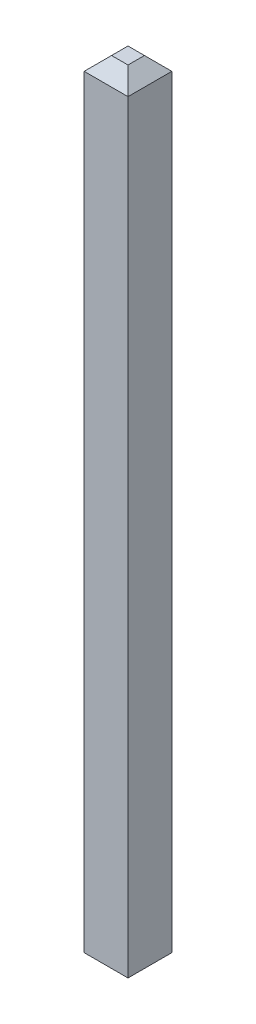
ISO-10303-21;
HEADER;
FILE_DESCRIPTION(('STEP AP214'),'2;1');
FILE_NAME('part.step','',(''),(''),'','','');
FILE_SCHEMA(('AUTOMOTIVE_DESIGN { 1 0 10303 214 1 1 1 1 }'));
ENDSEC;
DATA;
#1=APPLICATION_CONTEXT('core data for automotive mechanical design processes');
#2=APPLICATION_PROTOCOL_DEFINITION('international standard','automotive_design',2000,#1);
#3=PRODUCT_CONTEXT('',#1,'mechanical');
#4=PRODUCT('Part','Part','',(#3));
#5=PRODUCT_RELATED_PRODUCT_CATEGORY('part','',(#4));
#6=PRODUCT_DEFINITION_FORMATION('','',#4);
#7=PRODUCT_DEFINITION_CONTEXT('part definition',#1,'design');
#8=PRODUCT_DEFINITION('design','',#6,#7);
#9=PRODUCT_DEFINITION_SHAPE('','',#8);
#10=(LENGTH_UNIT() NAMED_UNIT(*) SI_UNIT(.MILLI.,.METRE.));
#11=(NAMED_UNIT(*) PLANE_ANGLE_UNIT() SI_UNIT($,.RADIAN.));
#12=(NAMED_UNIT(*) SI_UNIT($,.STERADIAN.) SOLID_ANGLE_UNIT());
#13=UNCERTAINTY_MEASURE_WITH_UNIT(LENGTH_MEASURE(1.E-05),#10,'distance_accuracy_value','');
#14=(GEOMETRIC_REPRESENTATION_CONTEXT(3) GLOBAL_UNCERTAINTY_ASSIGNED_CONTEXT((#13)) GLOBAL_UNIT_ASSIGNED_CONTEXT((#10,
#11,#12)) REPRESENTATION_CONTEXT('',''));
#15=CARTESIAN_POINT('',(0.,0.,0.));
#16=DIRECTION('',(0.,0.,1.));
#17=DIRECTION('',(1.,0.,0.));
#18=AXIS2_PLACEMENT_3D('',#15,#16,#17);
#19=CARTESIAN_POINT('',(-0.95,7.07,-0.32));
#20=DIRECTION('',(-0.707106781186548,-0.707106781186548,0.));
#21=DIRECTION('',(-0.707106781186548,0.707106781186548,0.));
#22=AXIS2_PLACEMENT_3D('',#19,#20,#21);
#23=PLANE('',#22);
#24=DIRECTION('',(0.577350269189626,-0.577350269189626,0.577350269189626));
#25=VECTOR('',#24,1.);
#26=CARTESIAN_POINT('',(-1.163333333333,7.283333333333,0.106666666667));
#27=LINE('',#26,#25);
#28=CARTESIAN_POINT('',(-1.15,7.27,0.12));
#29=VERTEX_POINT('',#28);
#30=CARTESIAN_POINT('',(-0.95,7.07,0.32));
#31=VERTEX_POINT('',#30);
#32=EDGE_CURVE('E68',#29,#31,#27,.T.);
#33=ORIENTED_EDGE('',*,*,#32,.T.);
#34=DIRECTION('',(0.,0.,1.));
#35=VECTOR('',#34,1.);
#36=CARTESIAN_POINT('',(-0.95,7.07,-0.32));
#37=LINE('',#36,#35);
#38=CARTESIAN_POINT('',(-0.95,7.07,-0.32));
#39=VERTEX_POINT('',#38);
#40=EDGE_CURVE('E20',#39,#31,#37,.T.);
#41=ORIENTED_EDGE('',*,*,#40,.F.);
#42=DIRECTION('',(0.577350269189626,-0.577350269189626,-0.577350269189626));
#43=VECTOR('',#42,1.);
#44=CARTESIAN_POINT('',(-0.95,7.07,-0.32));
#45=LINE('',#44,#43);
#46=CARTESIAN_POINT('',(-1.15,7.27,-0.12));
#47=VERTEX_POINT('',#46);
#48=EDGE_CURVE('E11',#47,#39,#45,.T.);
#49=ORIENTED_EDGE('',*,*,#48,.F.);
#50=DIRECTION('',(0.,0.,-1.));
#51=VECTOR('',#50,1.);
#52=CARTESIAN_POINT('',(-1.15,7.27,-0.32));
#53=LINE('',#52,#51);
#54=EDGE_CURVE('E186',#29,#47,#53,.T.);
#55=ORIENTED_EDGE('',*,*,#54,.F.);
#56=EDGE_LOOP('',(#33,#41,#49,#55));
#57=FACE_BOUND('',#56,.T.);
#58=ADVANCED_FACE('F16',(#57),#23,.F.);
#59=CARTESIAN_POINT('',(-1.27,7.07,-0.32));
#60=DIRECTION('',(0.,0.707106781186548,-0.707106781186548));
#61=DIRECTION('',(-1.,0.,0.));
#62=AXIS2_PLACEMENT_3D('',#59,#60,#61);
#63=PLANE('',#62);
#64=DIRECTION('',(0.577350269189626,0.577350269189626,0.577350269189626));
#65=VECTOR('',#64,1.);
#66=CARTESIAN_POINT('',(-1.456666666667,7.203333333333,-0.186666666667));
#67=LINE('',#66,#65);
#68=CARTESIAN_POINT('',(-1.59,7.07,-0.32));
#69=VERTEX_POINT('',#68);
#70=CARTESIAN_POINT('',(-1.39,7.27,-0.12));
#71=VERTEX_POINT('',#70);
#72=EDGE_CURVE('E27',#69,#71,#67,.T.);
#73=ORIENTED_EDGE('',*,*,#72,.T.);
#74=DIRECTION('',(-1.,0.,0.));
#75=VECTOR('',#74,1.);
#76=CARTESIAN_POINT('',(-1.59,7.27,-0.12));
#77=LINE('',#76,#75);
#78=EDGE_CURVE('E190',#47,#71,#77,.T.);
#79=ORIENTED_EDGE('',*,*,#78,.F.);
#80=ORIENTED_EDGE('',*,*,#48,.T.);
#81=DIRECTION('',(1.,0.,0.));
#82=VECTOR('',#81,1.);
#83=CARTESIAN_POINT('',(-0.95,7.07,-0.32));
#84=LINE('',#83,#82);
#85=EDGE_CURVE('E171',#69,#39,#84,.T.);
#86=ORIENTED_EDGE('',*,*,#85,.F.);
#87=EDGE_LOOP('',(#73,#79,#80,#86));
#88=FACE_BOUND('',#87,.T.);
#89=ADVANCED_FACE('F225',(#88),#63,.T.);
#90=CARTESIAN_POINT('',(-1.39,7.27,-0.32));
#91=DIRECTION('',(0.707106781186548,-0.707106781186548,0.));
#92=DIRECTION('',(0.,0.,-1.));
#93=AXIS2_PLACEMENT_3D('',#90,#91,#92);
#94=PLANE('',#93);
#95=DIRECTION('',(-0.577350269189626,-0.577350269189626,0.577350269189626));
#96=VECTOR('',#95,1.);
#97=CARTESIAN_POINT('',(-1.456666666667,7.203333333333,0.186666666667));
#98=LINE('',#97,#96);
#99=CARTESIAN_POINT('',(-1.39,7.27,0.12));
#100=VERTEX_POINT('',#99);
#101=CARTESIAN_POINT('',(-1.59,7.07,0.32));
#102=VERTEX_POINT('',#101);
#103=EDGE_CURVE('E41',#100,#102,#98,.T.);
#104=ORIENTED_EDGE('',*,*,#103,.F.);
#105=DIRECTION('',(0.,0.,1.));
#106=VECTOR('',#105,1.);
#107=CARTESIAN_POINT('',(-1.39,7.27,-0.32));
#108=LINE('',#107,#106);
#109=EDGE_CURVE('E208',#71,#100,#108,.T.);
#110=ORIENTED_EDGE('',*,*,#109,.F.);
#111=ORIENTED_EDGE('',*,*,#72,.F.);
#112=DIRECTION('',(0.,0.,-1.));
#113=VECTOR('',#112,1.);
#114=CARTESIAN_POINT('',(-1.59,7.07,-0.32));
#115=LINE('',#114,#113);
#116=EDGE_CURVE('E180',#102,#69,#115,.T.);
#117=ORIENTED_EDGE('',*,*,#116,.F.);
#118=EDGE_LOOP('',(#104,#110,#111,#117));
#119=FACE_BOUND('',#118,.T.);
#120=ADVANCED_FACE('F227',(#119),#94,.F.);
#121=CARTESIAN_POINT('',(-1.59,7.27,0.12));
#122=DIRECTION('',(0.,-0.707106781186548,-0.707106781186548));
#123=DIRECTION('',(0.,-0.707106781186548,0.707106781186548));
#124=AXIS2_PLACEMENT_3D('',#121,#122,#123);
#125=PLANE('',#124);
#126=ORIENTED_EDGE('',*,*,#32,.F.);
#127=DIRECTION('',(1.,0.,0.));
#128=VECTOR('',#127,1.);
#129=CARTESIAN_POINT('',(-1.59,7.27,0.12));
#130=LINE('',#129,#128);
#131=EDGE_CURVE('E167',#100,#29,#130,.T.);
#132=ORIENTED_EDGE('',*,*,#131,.F.);
#133=ORIENTED_EDGE('',*,*,#103,.T.);
#134=DIRECTION('',(-1.,0.,0.));
#135=VECTOR('',#134,1.);
#136=CARTESIAN_POINT('',(-1.27,7.07,0.32));
#137=LINE('',#136,#135);
#138=EDGE_CURVE('E161',#31,#102,#137,.T.);
#139=ORIENTED_EDGE('',*,*,#138,.F.);
#140=EDGE_LOOP('',(#126,#132,#133,#139));
#141=FACE_BOUND('',#140,.T.);
#142=ADVANCED_FACE('F229',(#141),#125,.F.);
#143=CARTESIAN_POINT('',(-1.59,7.27,-0.32));
#144=DIRECTION('',(0.,-1.,0.));
#145=DIRECTION('',(0.,0.,-1.));
#146=AXIS2_PLACEMENT_3D('',#143,#144,#145);
#147=PLANE('',#146);
#148=ORIENTED_EDGE('',*,*,#54,.T.);
#149=ORIENTED_EDGE('',*,*,#78,.T.);
#150=ORIENTED_EDGE('',*,*,#109,.T.);
#151=ORIENTED_EDGE('',*,*,#131,.T.);
#152=EDGE_LOOP('',(#148,#149,#150,#151));
#153=FACE_BOUND('',#152,.T.);
#154=ADVANCED_FACE('F223',(#153),#147,.F.);
#155=CARTESIAN_POINT('',(-0.95,7.27,-0.32));
#156=DIRECTION('',(-1.,0.,0.));
#157=DIRECTION('',(0.,1.,0.));
#158=AXIS2_PLACEMENT_3D('',#155,#156,#157);
#159=PLANE('',#158);
#160=DIRECTION('',(0.,-1.,0.));
#161=VECTOR('',#160,1.);
#162=CARTESIAN_POINT('',(-0.95,7.27,-0.32));
#163=LINE('',#162,#161);
#164=CARTESIAN_POINT('',(-0.95,-4.07,-0.32));
#165=VERTEX_POINT('',#164);
#166=EDGE_CURVE('E181',#39,#165,#163,.T.);
#167=ORIENTED_EDGE('',*,*,#166,.F.);
#168=ORIENTED_EDGE('',*,*,#40,.T.);
#169=DIRECTION('',(0.,-1.,0.));
#170=VECTOR('',#169,1.);
#171=CARTESIAN_POINT('',(-0.95,7.27,0.32));
#172=LINE('',#171,#170);
#173=CARTESIAN_POINT('',(-0.95,-4.07,0.32));
#174=VERTEX_POINT('',#173);
#175=EDGE_CURVE('E159',#31,#174,#172,.T.);
#176=ORIENTED_EDGE('',*,*,#175,.T.);
#177=DIRECTION('',(0.,0.,-1.));
#178=VECTOR('',#177,1.);
#179=CARTESIAN_POINT('',(-0.95,-4.07,-0.32));
#180=LINE('',#179,#178);
#181=EDGE_CURVE('E162',#174,#165,#180,.T.);
#182=ORIENTED_EDGE('',*,*,#181,.T.);
#183=EDGE_LOOP('',(#167,#168,#176,#182));
#184=FACE_BOUND('',#183,.T.);
#185=ADVANCED_FACE('F254',(#184),#159,.F.);
#186=CARTESIAN_POINT('',(-1.27,1.5,0.32));
#187=DIRECTION('',(0.,0.,-1.));
#188=DIRECTION('',(0.,-1.,0.));
#189=AXIS2_PLACEMENT_3D('',#186,#187,#188);
#190=PLANE('',#189);
#191=ORIENTED_EDGE('',*,*,#175,.F.);
#192=ORIENTED_EDGE('',*,*,#138,.T.);
#193=DIRECTION('',(0.,1.,0.));
#194=VECTOR('',#193,1.);
#195=CARTESIAN_POINT('',(-1.59,-4.27,0.32));
#196=LINE('',#195,#194);
#197=CARTESIAN_POINT('',(-1.59,-4.07,0.32));
#198=VERTEX_POINT('',#197);
#199=EDGE_CURVE('E176',#198,#102,#196,.T.);
#200=ORIENTED_EDGE('',*,*,#199,.F.);
#201=DIRECTION('',(1.,0.,0.));
#202=VECTOR('',#201,1.);
#203=CARTESIAN_POINT('',(-1.27,-4.07,0.32));
#204=LINE('',#203,#202);
#205=EDGE_CURVE('E175',#198,#174,#204,.T.);
#206=ORIENTED_EDGE('',*,*,#205,.T.);
#207=EDGE_LOOP('',(#191,#192,#200,#206));
#208=FACE_BOUND('',#207,.T.);
#209=ADVANCED_FACE('F257',(#208),#190,.F.);
#210=CARTESIAN_POINT('',(-1.15,-4.27,-0.32));
#211=DIRECTION('',(-0.707106781186548,0.707106781186548,0.));
#212=DIRECTION('',(0.,0.,1.));
#213=AXIS2_PLACEMENT_3D('',#210,#211,#212);
#214=PLANE('',#213);
#215=DIRECTION('',(-0.577350269189626,-0.577350269189626,0.577350269189626));
#216=VECTOR('',#215,1.);
#217=CARTESIAN_POINT('',(-1.083333333333,-4.203333333333,-0.186666666667));
#218=LINE('',#217,#216);
#219=CARTESIAN_POINT('',(-1.15,-4.27,-0.12));
#220=VERTEX_POINT('',#219);
#221=EDGE_CURVE('E126',#165,#220,#218,.T.);
#222=ORIENTED_EDGE('',*,*,#221,.F.);
#223=ORIENTED_EDGE('',*,*,#181,.F.);
#224=DIRECTION('',(-0.577350269189626,-0.577350269189626,-0.577350269189626));
#225=VECTOR('',#224,1.);
#226=CARTESIAN_POINT('',(-1.296666666667,-4.416666666667,-0.02666666666667));
#227=LINE('',#226,#225);
#228=CARTESIAN_POINT('',(-1.15,-4.27,0.12));
#229=VERTEX_POINT('',#228);
#230=EDGE_CURVE('E148',#174,#229,#227,.T.);
#231=ORIENTED_EDGE('',*,*,#230,.T.);
#232=DIRECTION('',(0.,0.,1.));
#233=VECTOR('',#232,1.);
#234=CARTESIAN_POINT('',(-1.15,-4.27,-0.32));
#235=LINE('',#234,#233);
#236=EDGE_CURVE('E142',#220,#229,#235,.T.);
#237=ORIENTED_EDGE('',*,*,#236,.F.);
#238=EDGE_LOOP('',(#222,#223,#231,#237));
#239=FACE_BOUND('',#238,.T.);
#240=ADVANCED_FACE('F146',(#239),#214,.F.);
#241=CARTESIAN_POINT('',(-0.95,-4.27,0.12));
#242=DIRECTION('',(0.,0.707106781186548,-0.707106781186548));
#243=DIRECTION('',(-1.,0.,0.));
#244=AXIS2_PLACEMENT_3D('',#241,#242,#243);
#245=PLANE('',#244);
#246=ORIENTED_EDGE('',*,*,#230,.F.);
#247=ORIENTED_EDGE('',*,*,#205,.F.);
#248=DIRECTION('',(-0.577350269189626,0.577350269189626,0.577350269189626));
#249=VECTOR('',#248,1.);
#250=CARTESIAN_POINT('',(-1.376666666667,-4.283333333333,0.106666666667));
#251=LINE('',#250,#249);
#252=CARTESIAN_POINT('',(-1.39,-4.27,0.12));
#253=VERTEX_POINT('',#252);
#254=EDGE_CURVE('E110',#253,#198,#251,.T.);
#255=ORIENTED_EDGE('',*,*,#254,.F.);
#256=DIRECTION('',(-1.,0.,0.));
#257=VECTOR('',#256,1.);
#258=CARTESIAN_POINT('',(-0.95,-4.27,0.12));
#259=LINE('',#258,#257);
#260=EDGE_CURVE('E150',#229,#253,#259,.T.);
#261=ORIENTED_EDGE('',*,*,#260,.F.);
#262=EDGE_LOOP('',(#246,#247,#255,#261));
#263=FACE_BOUND('',#262,.T.);
#264=ADVANCED_FACE('F253',(#263),#245,.F.);
#265=CARTESIAN_POINT('',(-1.59,-4.07,-0.32));
#266=DIRECTION('',(0.707106781186548,0.707106781186548,0.));
#267=DIRECTION('',(0.,0.,-1.));
#268=AXIS2_PLACEMENT_3D('',#265,#266,#267);
#269=PLANE('',#268);
#270=DIRECTION('',(0.577350269189626,-0.577350269189626,0.577350269189626));
#271=VECTOR('',#270,1.);
#272=CARTESIAN_POINT('',(-1.483333333333,-4.176666666667,-0.213333333333));
#273=LINE('',#272,#271);
#274=CARTESIAN_POINT('',(-1.59,-4.07,-0.32));
#275=VERTEX_POINT('',#274);
#276=CARTESIAN_POINT('',(-1.39,-4.27,-0.12));
#277=VERTEX_POINT('',#276);
#278=EDGE_CURVE('E99',#275,#277,#273,.T.);
#279=ORIENTED_EDGE('',*,*,#278,.T.);
#280=DIRECTION('',(0.,0.,-1.));
#281=VECTOR('',#280,1.);
#282=CARTESIAN_POINT('',(-1.39,-4.27,-0.32));
#283=LINE('',#282,#281);
#284=EDGE_CURVE('E143',#253,#277,#283,.T.);
#285=ORIENTED_EDGE('',*,*,#284,.F.);
#286=ORIENTED_EDGE('',*,*,#254,.T.);
#287=DIRECTION('',(0.,0.,1.));
#288=VECTOR('',#287,1.);
#289=CARTESIAN_POINT('',(-1.59,-4.07,-0.32));
#290=LINE('',#289,#288);
#291=EDGE_CURVE('E91',#275,#198,#290,.T.);
#292=ORIENTED_EDGE('',*,*,#291,.F.);
#293=EDGE_LOOP('',(#279,#285,#286,#292));
#294=FACE_BOUND('',#293,.T.);
#295=ADVANCED_FACE('F250',(#294),#269,.F.);
#296=CARTESIAN_POINT('',(-1.59,-4.27,-0.32));
#297=DIRECTION('',(1.,0.,0.));
#298=DIRECTION('',(0.,0.,1.));
#299=AXIS2_PLACEMENT_3D('',#296,#297,#298);
#300=PLANE('',#299);
#301=ORIENTED_EDGE('',*,*,#199,.T.);
#302=ORIENTED_EDGE('',*,*,#116,.T.);
#303=DIRECTION('',(0.,1.,0.));
#304=VECTOR('',#303,1.);
#305=CARTESIAN_POINT('',(-1.59,-4.27,-0.32));
#306=LINE('',#305,#304);
#307=EDGE_CURVE('E137',#275,#69,#306,.T.);
#308=ORIENTED_EDGE('',*,*,#307,.F.);
#309=ORIENTED_EDGE('',*,*,#291,.T.);
#310=EDGE_LOOP('',(#301,#302,#308,#309));
#311=FACE_BOUND('',#310,.T.);
#312=ADVANCED_FACE('F248',(#311),#300,.F.);
#313=CARTESIAN_POINT('',(-1.27,1.5,-0.32));
#314=DIRECTION('',(0.,0.,-1.));
#315=DIRECTION('',(0.,-1.,0.));
#316=AXIS2_PLACEMENT_3D('',#313,#314,#315);
#317=PLANE('',#316);
#318=ORIENTED_EDGE('',*,*,#307,.T.);
#319=ORIENTED_EDGE('',*,*,#85,.T.);
#320=ORIENTED_EDGE('',*,*,#166,.T.);
#321=DIRECTION('',(-1.,0.,0.));
#322=VECTOR('',#321,1.);
#323=CARTESIAN_POINT('',(-1.59,-4.07,-0.32));
#324=LINE('',#323,#322);
#325=EDGE_CURVE('E132',#165,#275,#324,.T.);
#326=ORIENTED_EDGE('',*,*,#325,.T.);
#327=EDGE_LOOP('',(#318,#319,#320,#326));
#328=FACE_BOUND('',#327,.T.);
#329=ADVANCED_FACE('F245',(#328),#317,.T.);
#330=CARTESIAN_POINT('',(-1.27,-4.07,-0.32));
#331=DIRECTION('',(0.,-0.707106781186548,-0.707106781186548));
#332=DIRECTION('',(0.,-0.707106781186548,0.707106781186548));
#333=AXIS2_PLACEMENT_3D('',#330,#331,#332);
#334=PLANE('',#333);
#335=ORIENTED_EDGE('',*,*,#278,.F.);
#336=ORIENTED_EDGE('',*,*,#325,.F.);
#337=ORIENTED_EDGE('',*,*,#221,.T.);
#338=DIRECTION('',(1.,0.,0.));
#339=VECTOR('',#338,1.);
#340=CARTESIAN_POINT('',(-0.95,-4.27,-0.12));
#341=LINE('',#340,#339);
#342=EDGE_CURVE('E129',#277,#220,#341,.T.);
#343=ORIENTED_EDGE('',*,*,#342,.F.);
#344=EDGE_LOOP('',(#335,#336,#337,#343));
#345=FACE_BOUND('',#344,.T.);
#346=ADVANCED_FACE('F128',(#345),#334,.T.);
#347=CARTESIAN_POINT('',(-0.95,-4.27,-0.32));
#348=DIRECTION('',(0.,1.,0.));
#349=DIRECTION('',(0.,0.,-1.));
#350=AXIS2_PLACEMENT_3D('',#347,#348,#349);
#351=PLANE('',#350);
#352=ORIENTED_EDGE('',*,*,#236,.T.);
#353=ORIENTED_EDGE('',*,*,#260,.T.);
#354=ORIENTED_EDGE('',*,*,#284,.T.);
#355=ORIENTED_EDGE('',*,*,#342,.T.);
#356=EDGE_LOOP('',(#352,#353,#354,#355));
#357=FACE_BOUND('',#356,.T.);
#358=ADVANCED_FACE('F18',(#357),#351,.F.);
#359=CLOSED_SHELL('',(#58,#89,#120,#142,#154,#185,#209,#240,#264,#295,#312,#329,#346,#358));
#360=MANIFOLD_SOLID_BREP('B1',#359);
#361=ADVANCED_BREP_SHAPE_REPRESENTATION('',(#18,#360),#14);
#362=SHAPE_DEFINITION_REPRESENTATION(#9,#361);
ENDSEC;
END-ISO-10303-21;
